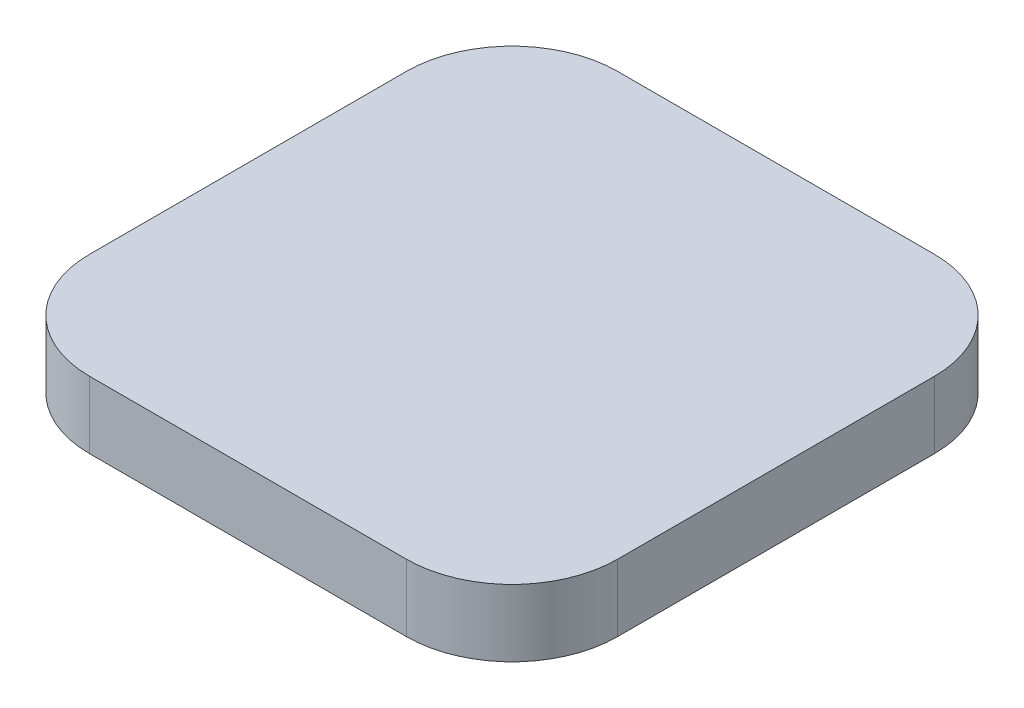
ISO-10303-21;
HEADER;
FILE_DESCRIPTION(('STEP AP214'),'2;1');
FILE_NAME('part.step','',(''),(''),'','','');
FILE_SCHEMA(('AUTOMOTIVE_DESIGN { 1 0 10303 214 1 1 1 1 }'));
ENDSEC;
DATA;
#1=APPLICATION_CONTEXT('core data for automotive mechanical design processes');
#2=APPLICATION_PROTOCOL_DEFINITION('international standard','automotive_design',2000,#1);
#3=PRODUCT_CONTEXT('',#1,'mechanical');
#4=PRODUCT('Part','Part','',(#3));
#5=PRODUCT_RELATED_PRODUCT_CATEGORY('part','',(#4));
#6=PRODUCT_DEFINITION_FORMATION('','',#4);
#7=PRODUCT_DEFINITION_CONTEXT('part definition',#1,'design');
#8=PRODUCT_DEFINITION('design','',#6,#7);
#9=PRODUCT_DEFINITION_SHAPE('','',#8);
#10=(LENGTH_UNIT() NAMED_UNIT(*) SI_UNIT(.MILLI.,.METRE.));
#11=(NAMED_UNIT(*) PLANE_ANGLE_UNIT() SI_UNIT($,.RADIAN.));
#12=(NAMED_UNIT(*) SI_UNIT($,.STERADIAN.) SOLID_ANGLE_UNIT());
#13=UNCERTAINTY_MEASURE_WITH_UNIT(LENGTH_MEASURE(1.E-05),#10,'distance_accuracy_value','');
#14=(GEOMETRIC_REPRESENTATION_CONTEXT(3) GLOBAL_UNCERTAINTY_ASSIGNED_CONTEXT((#13)) GLOBAL_UNIT_ASSIGNED_CONTEXT((#10,
#11,#12)) REPRESENTATION_CONTEXT('',''));
#15=CARTESIAN_POINT('',(0.,0.,0.));
#16=DIRECTION('',(0.,0.,1.));
#17=DIRECTION('',(1.,0.,0.));
#18=AXIS2_PLACEMENT_3D('',#15,#16,#17);
#19=CARTESIAN_POINT('',(0.,3.175,0.));
#20=DIRECTION('',(1.,0.,0.));
#21=DIRECTION('',(0.,0.,-1.));
#22=AXIS2_PLACEMENT_3D('',#19,#20,#21);
#23=PLANE('',#22);
#24=DIRECTION('',(0.,0.,1.));
#25=VECTOR('',#24,1.);
#26=CARTESIAN_POINT('',(0.,3.175,0.));
#27=LINE('',#26,#25);
#28=CARTESIAN_POINT('',(0.,3.175,5.));
#29=VERTEX_POINT('',#28);
#30=CARTESIAN_POINT('',(0.,3.175,20.));
#31=VERTEX_POINT('',#30);
#32=EDGE_CURVE('E117',#29,#31,#27,.T.);
#33=ORIENTED_EDGE('',*,*,#32,.F.);
#34=DIRECTION('',(0.,-1.,0.));
#35=VECTOR('',#34,1.);
#36=CARTESIAN_POINT('',(0.,3.175,5.));
#37=LINE('',#36,#35);
#38=CARTESIAN_POINT('',(0.,0.,5.));
#39=VERTEX_POINT('',#38);
#40=EDGE_CURVE('E102',#29,#39,#37,.T.);
#41=ORIENTED_EDGE('',*,*,#40,.T.);
#42=DIRECTION('',(0.,0.,1.));
#43=VECTOR('',#42,1.);
#44=CARTESIAN_POINT('',(0.,0.,0.));
#45=LINE('',#44,#43);
#46=CARTESIAN_POINT('',(0.,0.,20.));
#47=VERTEX_POINT('',#46);
#48=EDGE_CURVE('E114',#39,#47,#45,.T.);
#49=ORIENTED_EDGE('',*,*,#48,.T.);
#50=DIRECTION('',(0.,-1.,0.));
#51=VECTOR('',#50,1.);
#52=CARTESIAN_POINT('',(0.,3.175,20.));
#53=LINE('',#52,#51);
#54=EDGE_CURVE('E119',#47,#31,#53,.F.);
#55=ORIENTED_EDGE('',*,*,#54,.T.);
#56=EDGE_LOOP('',(#33,#41,#49,#55));
#57=FACE_BOUND('',#56,.T.);
#58=ADVANCED_FACE('F33',(#57),#23,.F.);
#59=CARTESIAN_POINT('',(0.,3.175,25.));
#60=DIRECTION('',(0.,0.,-1.));
#61=DIRECTION('',(-1.,0.,0.));
#62=AXIS2_PLACEMENT_3D('',#59,#60,#61);
#63=PLANE('',#62);
#64=DIRECTION('',(1.,0.,0.));
#65=VECTOR('',#64,1.);
#66=CARTESIAN_POINT('',(0.,3.175,25.));
#67=LINE('',#66,#65);
#68=CARTESIAN_POINT('',(5.,3.175,25.));
#69=VERTEX_POINT('',#68);
#70=CARTESIAN_POINT('',(20.,3.175,25.));
#71=VERTEX_POINT('',#70);
#72=EDGE_CURVE('E168',#69,#71,#67,.T.);
#73=ORIENTED_EDGE('',*,*,#72,.F.);
#74=DIRECTION('',(0.,-1.,0.));
#75=VECTOR('',#74,1.);
#76=CARTESIAN_POINT('',(5.,3.175,25.));
#77=LINE('',#76,#75);
#78=CARTESIAN_POINT('',(5.,0.,25.));
#79=VERTEX_POINT('',#78);
#80=EDGE_CURVE('E152',#69,#79,#77,.T.);
#81=ORIENTED_EDGE('',*,*,#80,.T.);
#82=DIRECTION('',(1.,0.,0.));
#83=VECTOR('',#82,1.);
#84=CARTESIAN_POINT('',(0.,0.,25.));
#85=LINE('',#84,#83);
#86=CARTESIAN_POINT('',(20.,0.,25.));
#87=VERTEX_POINT('',#86);
#88=EDGE_CURVE('E123',#79,#87,#85,.T.);
#89=ORIENTED_EDGE('',*,*,#88,.T.);
#90=DIRECTION('',(0.,-1.,0.));
#91=VECTOR('',#90,1.);
#92=CARTESIAN_POINT('',(20.,3.175,25.));
#93=LINE('',#92,#91);
#94=EDGE_CURVE('E150',#87,#71,#93,.F.);
#95=ORIENTED_EDGE('',*,*,#94,.T.);
#96=EDGE_LOOP('',(#73,#81,#89,#95));
#97=FACE_BOUND('',#96,.T.);
#98=ADVANCED_FACE('F178',(#97),#63,.F.);
#99=CARTESIAN_POINT('',(25.,3.175,0.));
#100=DIRECTION('',(-1.,0.,0.));
#101=DIRECTION('',(0.,0.,1.));
#102=AXIS2_PLACEMENT_3D('',#99,#100,#101);
#103=PLANE('',#102);
#104=DIRECTION('',(0.,0.,-1.));
#105=VECTOR('',#104,1.);
#106=CARTESIAN_POINT('',(25.,0.,0.));
#107=LINE('',#106,#105);
#108=CARTESIAN_POINT('',(25.,0.,20.));
#109=VERTEX_POINT('',#108);
#110=CARTESIAN_POINT('',(25.,0.,5.));
#111=VERTEX_POINT('',#110);
#112=EDGE_CURVE('E126',#109,#111,#107,.T.);
#113=ORIENTED_EDGE('',*,*,#112,.T.);
#114=DIRECTION('',(0.,-1.,0.));
#115=VECTOR('',#114,1.);
#116=CARTESIAN_POINT('',(25.,3.175,5.));
#117=LINE('',#116,#115);
#118=CARTESIAN_POINT('',(25.,3.175,5.));
#119=VERTEX_POINT('',#118);
#120=EDGE_CURVE('E11',#111,#119,#117,.F.);
#121=ORIENTED_EDGE('',*,*,#120,.T.);
#122=DIRECTION('',(0.,0.,-1.));
#123=VECTOR('',#122,1.);
#124=CARTESIAN_POINT('',(25.,3.175,0.));
#125=LINE('',#124,#123);
#126=CARTESIAN_POINT('',(25.,3.175,20.));
#127=VERTEX_POINT('',#126);
#128=EDGE_CURVE('E158',#127,#119,#125,.T.);
#129=ORIENTED_EDGE('',*,*,#128,.F.);
#130=DIRECTION('',(0.,-1.,0.));
#131=VECTOR('',#130,1.);
#132=CARTESIAN_POINT('',(25.,3.175,20.));
#133=LINE('',#132,#131);
#134=EDGE_CURVE('E41',#127,#109,#133,.T.);
#135=ORIENTED_EDGE('',*,*,#134,.T.);
#136=EDGE_LOOP('',(#113,#121,#129,#135));
#137=FACE_BOUND('',#136,.T.);
#138=ADVANCED_FACE('F157',(#137),#103,.F.);
#139=CARTESIAN_POINT('',(0.,3.175,0.));
#140=DIRECTION('',(0.,0.,1.));
#141=DIRECTION('',(1.,0.,0.));
#142=AXIS2_PLACEMENT_3D('',#139,#140,#141);
#143=PLANE('',#142);
#144=DIRECTION('',(-1.,0.,0.));
#145=VECTOR('',#144,1.);
#146=CARTESIAN_POINT('',(0.,0.,0.));
#147=LINE('',#146,#145);
#148=CARTESIAN_POINT('',(20.,0.,0.));
#149=VERTEX_POINT('',#148);
#150=CARTESIAN_POINT('',(5.,0.,0.));
#151=VERTEX_POINT('',#150);
#152=EDGE_CURVE('E133',#149,#151,#147,.T.);
#153=ORIENTED_EDGE('',*,*,#152,.T.);
#154=DIRECTION('',(0.,-1.,0.));
#155=VECTOR('',#154,1.);
#156=CARTESIAN_POINT('',(5.,3.175,0.));
#157=LINE('',#156,#155);
#158=CARTESIAN_POINT('',(5.,3.175,0.));
#159=VERTEX_POINT('',#158);
#160=EDGE_CURVE('E103',#151,#159,#157,.F.);
#161=ORIENTED_EDGE('',*,*,#160,.T.);
#162=DIRECTION('',(-1.,0.,0.));
#163=VECTOR('',#162,1.);
#164=CARTESIAN_POINT('',(0.,3.175,0.));
#165=LINE('',#164,#163);
#166=CARTESIAN_POINT('',(20.,3.175,0.));
#167=VERTEX_POINT('',#166);
#168=EDGE_CURVE('E129',#167,#159,#165,.T.);
#169=ORIENTED_EDGE('',*,*,#168,.F.);
#170=DIRECTION('',(0.,-1.,0.));
#171=VECTOR('',#170,1.);
#172=CARTESIAN_POINT('',(20.,3.175,0.));
#173=LINE('',#172,#171);
#174=EDGE_CURVE('E108',#167,#149,#173,.T.);
#175=ORIENTED_EDGE('',*,*,#174,.T.);
#176=EDGE_LOOP('',(#153,#161,#169,#175));
#177=FACE_BOUND('',#176,.T.);
#178=ADVANCED_FACE('F166',(#177),#143,.F.);
#179=CARTESIAN_POINT('',(0.,3.175,0.));
#180=DIRECTION('',(0.,1.,0.));
#181=DIRECTION('',(0.,0.,1.));
#182=AXIS2_PLACEMENT_3D('',#179,#180,#181);
#183=PLANE('',#182);
#184=ORIENTED_EDGE('',*,*,#168,.T.);
#185=CARTESIAN_POINT('',(5.,3.175,5.));
#186=DIRECTION('',(0.,1.,0.));
#187=DIRECTION('',(0.,0.,1.));
#188=AXIS2_PLACEMENT_3D('',#185,#186,#187);
#189=CIRCLE('',#188,5.);
#190=EDGE_CURVE('E148',#159,#29,#189,.T.);
#191=ORIENTED_EDGE('',*,*,#190,.T.);
#192=ORIENTED_EDGE('',*,*,#32,.T.);
#193=CARTESIAN_POINT('',(5.,3.175,20.));
#194=DIRECTION('',(0.,1.,0.));
#195=DIRECTION('',(0.,0.,1.));
#196=AXIS2_PLACEMENT_3D('',#193,#194,#195);
#197=CIRCLE('',#196,5.);
#198=EDGE_CURVE('E146',#31,#69,#197,.T.);
#199=ORIENTED_EDGE('',*,*,#198,.T.);
#200=ORIENTED_EDGE('',*,*,#72,.T.);
#201=CARTESIAN_POINT('',(20.,3.175,20.));
#202=DIRECTION('',(0.,1.,0.));
#203=DIRECTION('',(0.,0.,1.));
#204=AXIS2_PLACEMENT_3D('',#201,#202,#203);
#205=CIRCLE('',#204,5.);
#206=EDGE_CURVE('E53',#71,#127,#205,.T.);
#207=ORIENTED_EDGE('',*,*,#206,.T.);
#208=ORIENTED_EDGE('',*,*,#128,.T.);
#209=CARTESIAN_POINT('',(20.,3.175,5.));
#210=DIRECTION('',(0.,1.,0.));
#211=DIRECTION('',(0.,0.,1.));
#212=AXIS2_PLACEMENT_3D('',#209,#210,#211);
#213=CIRCLE('',#212,5.);
#214=EDGE_CURVE('E144',#119,#167,#213,.T.);
#215=ORIENTED_EDGE('',*,*,#214,.T.);
#216=EDGE_LOOP('',(#184,#191,#192,#199,#200,#207,#208,#215));
#217=FACE_BOUND('',#216,.T.);
#218=ADVANCED_FACE('F172',(#217),#183,.T.);
#219=CARTESIAN_POINT('',(0.,0.,0.));
#220=DIRECTION('',(0.,1.,0.));
#221=DIRECTION('',(0.,0.,1.));
#222=AXIS2_PLACEMENT_3D('',#219,#220,#221);
#223=PLANE('',#222);
#224=ORIENTED_EDGE('',*,*,#48,.F.);
#225=CARTESIAN_POINT('',(5.,0.,5.));
#226=DIRECTION('',(0.,1.,0.));
#227=DIRECTION('',(0.,0.,1.));
#228=AXIS2_PLACEMENT_3D('',#225,#226,#227);
#229=CIRCLE('',#228,5.);
#230=EDGE_CURVE('E98',#39,#151,#229,.F.);
#231=ORIENTED_EDGE('',*,*,#230,.T.);
#232=ORIENTED_EDGE('',*,*,#152,.F.);
#233=CARTESIAN_POINT('',(20.,0.,5.));
#234=DIRECTION('',(0.,1.,0.));
#235=DIRECTION('',(0.,0.,1.));
#236=AXIS2_PLACEMENT_3D('',#233,#234,#235);
#237=CIRCLE('',#236,5.);
#238=EDGE_CURVE('E137',#149,#111,#237,.F.);
#239=ORIENTED_EDGE('',*,*,#238,.T.);
#240=ORIENTED_EDGE('',*,*,#112,.F.);
#241=CARTESIAN_POINT('',(20.,0.,20.));
#242=DIRECTION('',(0.,1.,0.));
#243=DIRECTION('',(0.,0.,1.));
#244=AXIS2_PLACEMENT_3D('',#241,#242,#243);
#245=CIRCLE('',#244,5.);
#246=EDGE_CURVE('E118',#109,#87,#245,.F.);
#247=ORIENTED_EDGE('',*,*,#246,.T.);
#248=ORIENTED_EDGE('',*,*,#88,.F.);
#249=CARTESIAN_POINT('',(5.,0.,20.));
#250=DIRECTION('',(0.,1.,0.));
#251=DIRECTION('',(0.,0.,1.));
#252=AXIS2_PLACEMENT_3D('',#249,#250,#251);
#253=CIRCLE('',#252,5.);
#254=EDGE_CURVE('E109',#79,#47,#253,.F.);
#255=ORIENTED_EDGE('',*,*,#254,.T.);
#256=EDGE_LOOP('',(#224,#231,#232,#239,#240,#247,#248,#255));
#257=FACE_BOUND('',#256,.T.);
#258=ADVANCED_FACE('F121',(#257),#223,.F.);
#259=CARTESIAN_POINT('',(5.,3.175,5.));
#260=DIRECTION('',(0.,-1.,0.));
#261=DIRECTION('',(0.,0.,-1.));
#262=AXIS2_PLACEMENT_3D('',#259,#260,#261);
#263=CYLINDRICAL_SURFACE('',#262,5.);
#264=ORIENTED_EDGE('',*,*,#190,.F.);
#265=ORIENTED_EDGE('',*,*,#160,.F.);
#266=ORIENTED_EDGE('',*,*,#230,.F.);
#267=ORIENTED_EDGE('',*,*,#40,.F.);
#268=EDGE_LOOP('',(#264,#265,#266,#267));
#269=FACE_BOUND('',#268,.T.);
#270=ADVANCED_FACE('F101',(#269),#263,.T.);
#271=CARTESIAN_POINT('',(5.,3.175,20.));
#272=DIRECTION('',(0.,-1.,0.));
#273=DIRECTION('',(0.,0.,-1.));
#274=AXIS2_PLACEMENT_3D('',#271,#272,#273);
#275=CYLINDRICAL_SURFACE('',#274,5.);
#276=ORIENTED_EDGE('',*,*,#198,.F.);
#277=ORIENTED_EDGE('',*,*,#54,.F.);
#278=ORIENTED_EDGE('',*,*,#254,.F.);
#279=ORIENTED_EDGE('',*,*,#80,.F.);
#280=EDGE_LOOP('',(#276,#277,#278,#279));
#281=FACE_BOUND('',#280,.T.);
#282=ADVANCED_FACE('F176',(#281),#275,.T.);
#283=CARTESIAN_POINT('',(20.,3.175,5.));
#284=DIRECTION('',(0.,-1.,0.));
#285=DIRECTION('',(0.,0.,-1.));
#286=AXIS2_PLACEMENT_3D('',#283,#284,#285);
#287=CYLINDRICAL_SURFACE('',#286,5.);
#288=ORIENTED_EDGE('',*,*,#214,.F.);
#289=ORIENTED_EDGE('',*,*,#120,.F.);
#290=ORIENTED_EDGE('',*,*,#238,.F.);
#291=ORIENTED_EDGE('',*,*,#174,.F.);
#292=EDGE_LOOP('',(#288,#289,#290,#291));
#293=FACE_BOUND('',#292,.T.);
#294=ADVANCED_FACE('F163',(#293),#287,.T.);
#295=CARTESIAN_POINT('',(20.,3.175,20.));
#296=DIRECTION('',(0.,-1.,0.));
#297=DIRECTION('',(0.,0.,-1.));
#298=AXIS2_PLACEMENT_3D('',#295,#296,#297);
#299=CYLINDRICAL_SURFACE('',#298,5.);
#300=ORIENTED_EDGE('',*,*,#206,.F.);
#301=ORIENTED_EDGE('',*,*,#94,.F.);
#302=ORIENTED_EDGE('',*,*,#246,.F.);
#303=ORIENTED_EDGE('',*,*,#134,.F.);
#304=EDGE_LOOP('',(#300,#301,#302,#303));
#305=FACE_BOUND('',#304,.T.);
#306=ADVANCED_FACE('F35',(#305),#299,.T.);
#307=CLOSED_SHELL('',(#58,#98,#138,#178,#218,#258,#270,#282,#294,#306));
#308=MANIFOLD_SOLID_BREP('B2',#307);
#309=ADVANCED_BREP_SHAPE_REPRESENTATION('',(#18,#308),#14);
#310=SHAPE_DEFINITION_REPRESENTATION(#9,#309);
ENDSEC;
END-ISO-10303-21;
